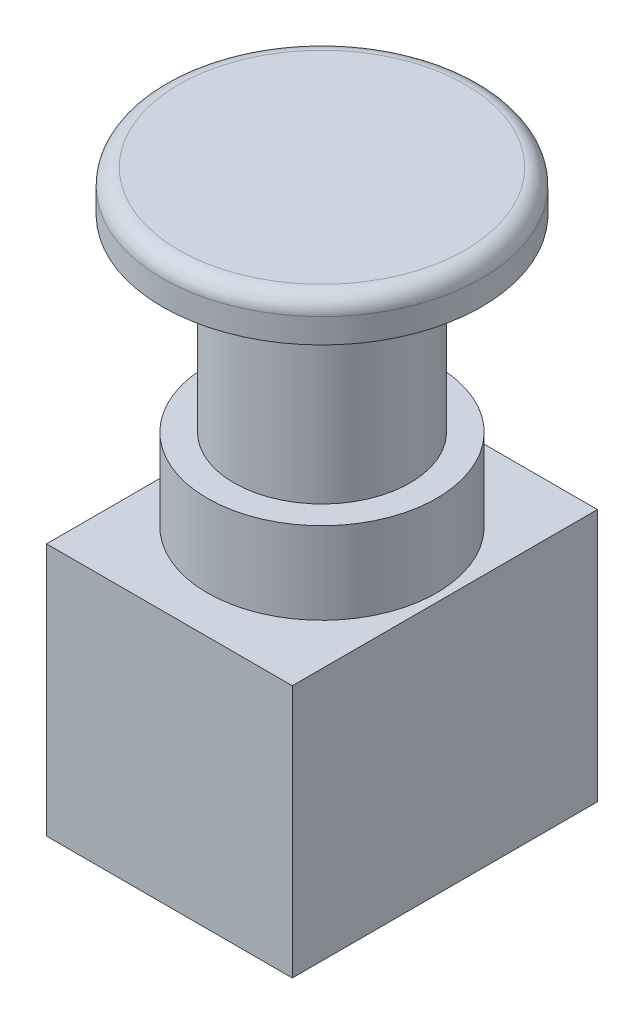
ISO-10303-21;
HEADER;
FILE_DESCRIPTION(('STEP AP214'),'2;1');
FILE_NAME('part.step','',(''),(''),'','','');
FILE_SCHEMA(('AUTOMOTIVE_DESIGN { 1 0 10303 214 1 1 1 1 }'));
ENDSEC;
DATA;
#1=APPLICATION_CONTEXT('core data for automotive mechanical design processes');
#2=APPLICATION_PROTOCOL_DEFINITION('international standard','automotive_design',2000,#1);
#3=PRODUCT_CONTEXT('',#1,'mechanical');
#4=PRODUCT('Part','Part','',(#3));
#5=PRODUCT_RELATED_PRODUCT_CATEGORY('part','',(#4));
#6=PRODUCT_DEFINITION_FORMATION('','',#4);
#7=PRODUCT_DEFINITION_CONTEXT('part definition',#1,'design');
#8=PRODUCT_DEFINITION('design','',#6,#7);
#9=PRODUCT_DEFINITION_SHAPE('','',#8);
#10=(LENGTH_UNIT() NAMED_UNIT(*) SI_UNIT(.MILLI.,.METRE.));
#11=(NAMED_UNIT(*) PLANE_ANGLE_UNIT() SI_UNIT($,.RADIAN.));
#12=(NAMED_UNIT(*) SI_UNIT($,.STERADIAN.) SOLID_ANGLE_UNIT());
#13=UNCERTAINTY_MEASURE_WITH_UNIT(LENGTH_MEASURE(1.E-05),#10,'distance_accuracy_value','');
#14=(GEOMETRIC_REPRESENTATION_CONTEXT(3) GLOBAL_UNCERTAINTY_ASSIGNED_CONTEXT((#13)) GLOBAL_UNIT_ASSIGNED_CONTEXT((#10,
#11,#12)) REPRESENTATION_CONTEXT('',''));
#15=CARTESIAN_POINT('',(0.,0.,0.));
#16=DIRECTION('',(0.,0.,1.));
#17=DIRECTION('',(1.,0.,0.));
#18=AXIS2_PLACEMENT_3D('',#15,#16,#17);
#19=CARTESIAN_POINT('',(0.,68.9,0.));
#20=DIRECTION('',(0.,-1.,0.));
#21=DIRECTION('',(0.,0.,-1.));
#22=AXIS2_PLACEMENT_3D('',#19,#20,#21);
#23=CYLINDRICAL_SURFACE('',#22,19.5);
#24=CARTESIAN_POINT('',(0.,66.9,0.));
#25=DIRECTION('',(0.,1.,0.));
#26=DIRECTION('',(0.,0.,1.));
#27=AXIS2_PLACEMENT_3D('',#24,#25,#26);
#28=CIRCLE('',#27,19.5);
#29=CARTESIAN_POINT('',(0.,66.9,19.5));
#30=VERTEX_POINT('',#29);
#31=EDGE_CURVE('E11',#30,#30,#28,.F.);
#32=ORIENTED_EDGE('',*,*,#31,.T.);
#33=EDGE_LOOP('',(#32));
#34=FACE_BOUND('',#33,.T.);
#35=CARTESIAN_POINT('',(0.,63.9,0.));
#36=DIRECTION('',(0.,1.,0.));
#37=DIRECTION('',(0.,0.,1.));
#38=AXIS2_PLACEMENT_3D('',#35,#36,#37);
#39=CIRCLE('',#38,19.5);
#40=CARTESIAN_POINT('',(0.,63.9,19.5));
#41=VERTEX_POINT('',#40);
#42=EDGE_CURVE('E52',#41,#41,#39,.T.);
#43=ORIENTED_EDGE('',*,*,#42,.T.);
#44=EDGE_LOOP('',(#43));
#45=FACE_BOUND('',#44,.T.);
#46=ADVANCED_FACE('F41',(#34,#45),#23,.T.);
#47=CARTESIAN_POINT('',(0.,68.9,0.));
#48=DIRECTION('',(0.,1.,0.));
#49=DIRECTION('',(0.,0.,1.));
#50=AXIS2_PLACEMENT_3D('',#47,#48,#49);
#51=PLANE('',#50);
#52=CARTESIAN_POINT('',(0.,68.9,0.));
#53=DIRECTION('',(0.,1.,0.));
#54=DIRECTION('',(0.,0.,1.));
#55=AXIS2_PLACEMENT_3D('',#52,#53,#54);
#56=CIRCLE('',#55,17.5);
#57=CARTESIAN_POINT('',(0.,68.9,17.5));
#58=VERTEX_POINT('',#57);
#59=EDGE_CURVE('E48',#58,#58,#56,.T.);
#60=ORIENTED_EDGE('',*,*,#59,.T.);
#61=EDGE_LOOP('',(#60));
#62=FACE_BOUND('',#61,.T.);
#63=ADVANCED_FACE('F62',(#62),#51,.T.);
#64=CARTESIAN_POINT('',(0.,63.9,0.));
#65=DIRECTION('',(0.,1.,0.));
#66=DIRECTION('',(0.,0.,1.));
#67=AXIS2_PLACEMENT_3D('',#64,#65,#66);
#68=PLANE('',#67);
#69=ORIENTED_EDGE('',*,*,#42,.F.);
#70=EDGE_LOOP('',(#69));
#71=FACE_BOUND('',#70,.T.);
#72=ADVANCED_FACE('F60',(#71),#68,.F.);
#73=CARTESIAN_POINT('',(0.,66.9,0.));
#74=DIRECTION('',(0.,1.,0.));
#75=DIRECTION('',(0.,0.,1.));
#76=AXIS2_PLACEMENT_3D('',#73,#74,#75);
#77=TOROIDAL_SURFACE('',#76,17.5,2.);
#78=ORIENTED_EDGE('',*,*,#31,.F.);
#79=EDGE_LOOP('',(#78));
#80=FACE_BOUND('',#79,.T.);
#81=ORIENTED_EDGE('',*,*,#59,.F.);
#82=EDGE_LOOP('',(#81));
#83=FACE_BOUND('',#82,.T.);
#84=ADVANCED_FACE('F43',(#80,#83),#77,.T.);
#85=CLOSED_SHELL('',(#46,#63,#72,#84));
#86=MANIFOLD_SOLID_BREP('B2',#85);
#87=CARTESIAN_POINT('',(15.,30.9,18.625));
#88=DIRECTION('',(-1.,0.,0.));
#89=DIRECTION('',(0.,0.,1.));
#90=AXIS2_PLACEMENT_3D('',#87,#88,#89);
#91=PLANE('',#90);
#92=DIRECTION('',(0.,0.,-1.));
#93=VECTOR('',#92,1.);
#94=CARTESIAN_POINT('',(15.,0.,18.625));
#95=LINE('',#94,#93);
#96=CARTESIAN_POINT('',(15.,0.,18.625));
#97=VERTEX_POINT('',#96);
#98=CARTESIAN_POINT('',(15.,0.,-18.625));
#99=VERTEX_POINT('',#98);
#100=EDGE_CURVE('E164',#97,#99,#95,.T.);
#101=ORIENTED_EDGE('',*,*,#100,.T.);
#102=DIRECTION('',(0.,-1.,0.));
#103=VECTOR('',#102,1.);
#104=CARTESIAN_POINT('',(15.,30.9,-18.625));
#105=LINE('',#104,#103);
#106=CARTESIAN_POINT('',(15.,30.9,-18.625));
#107=VERTEX_POINT('',#106);
#108=EDGE_CURVE('E100',#107,#99,#105,.T.);
#109=ORIENTED_EDGE('',*,*,#108,.F.);
#110=DIRECTION('',(0.,0.,-1.));
#111=VECTOR('',#110,1.);
#112=CARTESIAN_POINT('',(15.,30.9,18.625));
#113=LINE('',#112,#111);
#114=CARTESIAN_POINT('',(15.,30.9,18.625));
#115=VERTEX_POINT('',#114);
#116=EDGE_CURVE('E151',#115,#107,#113,.T.);
#117=ORIENTED_EDGE('',*,*,#116,.F.);
#118=DIRECTION('',(0.,-1.,0.));
#119=VECTOR('',#118,1.);
#120=CARTESIAN_POINT('',(15.,30.9,18.625));
#121=LINE('',#120,#119);
#122=EDGE_CURVE('E160',#115,#97,#121,.T.);
#123=ORIENTED_EDGE('',*,*,#122,.T.);
#124=EDGE_LOOP('',(#101,#109,#117,#123));
#125=FACE_BOUND('',#124,.T.);
#126=ADVANCED_FACE('F97',(#125),#91,.F.);
#127=CARTESIAN_POINT('',(-15.,30.9,-18.625));
#128=DIRECTION('',(0.,0.,1.));
#129=DIRECTION('',(1.,0.,0.));
#130=AXIS2_PLACEMENT_3D('',#127,#128,#129);
#131=PLANE('',#130);
#132=DIRECTION('',(-1.,0.,0.));
#133=VECTOR('',#132,1.);
#134=CARTESIAN_POINT('',(-15.,0.,-18.625));
#135=LINE('',#134,#133);
#136=CARTESIAN_POINT('',(-15.,0.,-18.625));
#137=VERTEX_POINT('',#136);
#138=EDGE_CURVE('E156',#99,#137,#135,.T.);
#139=ORIENTED_EDGE('',*,*,#138,.T.);
#140=DIRECTION('',(0.,-1.,0.));
#141=VECTOR('',#140,1.);
#142=CARTESIAN_POINT('',(-15.,30.9,-18.625));
#143=LINE('',#142,#141);
#144=CARTESIAN_POINT('',(-15.,30.9,-18.625));
#145=VERTEX_POINT('',#144);
#146=EDGE_CURVE('E154',#145,#137,#143,.T.);
#147=ORIENTED_EDGE('',*,*,#146,.F.);
#148=DIRECTION('',(-1.,0.,0.));
#149=VECTOR('',#148,1.);
#150=CARTESIAN_POINT('',(-15.,30.9,-18.625));
#151=LINE('',#150,#149);
#152=EDGE_CURVE('E146',#107,#145,#151,.T.);
#153=ORIENTED_EDGE('',*,*,#152,.F.);
#154=ORIENTED_EDGE('',*,*,#108,.T.);
#155=EDGE_LOOP('',(#139,#147,#153,#154));
#156=FACE_BOUND('',#155,.T.);
#157=ADVANCED_FACE('F155',(#156),#131,.F.);
#158=CARTESIAN_POINT('',(-15.,30.9,18.625));
#159=DIRECTION('',(1.,0.,0.));
#160=DIRECTION('',(0.,0.,-1.));
#161=AXIS2_PLACEMENT_3D('',#158,#159,#160);
#162=PLANE('',#161);
#163=DIRECTION('',(0.,0.,1.));
#164=VECTOR('',#163,1.);
#165=CARTESIAN_POINT('',(-15.,0.,18.625));
#166=LINE('',#165,#164);
#167=CARTESIAN_POINT('',(-15.,0.,18.625));
#168=VERTEX_POINT('',#167);
#169=EDGE_CURVE('E132',#137,#168,#166,.T.);
#170=ORIENTED_EDGE('',*,*,#169,.T.);
#171=DIRECTION('',(0.,-1.,0.));
#172=VECTOR('',#171,1.);
#173=CARTESIAN_POINT('',(-15.,30.9,18.625));
#174=LINE('',#173,#172);
#175=CARTESIAN_POINT('',(-15.,30.9,18.625));
#176=VERTEX_POINT('',#175);
#177=EDGE_CURVE('E157',#176,#168,#174,.T.);
#178=ORIENTED_EDGE('',*,*,#177,.F.);
#179=DIRECTION('',(0.,0.,1.));
#180=VECTOR('',#179,1.);
#181=CARTESIAN_POINT('',(-15.,30.9,18.625));
#182=LINE('',#181,#180);
#183=EDGE_CURVE('E149',#145,#176,#182,.T.);
#184=ORIENTED_EDGE('',*,*,#183,.F.);
#185=ORIENTED_EDGE('',*,*,#146,.T.);
#186=EDGE_LOOP('',(#170,#178,#184,#185));
#187=FACE_BOUND('',#186,.T.);
#188=ADVANCED_FACE('F158',(#187),#162,.F.);
#189=CARTESIAN_POINT('',(-15.,30.9,18.625));
#190=DIRECTION('',(0.,0.,-1.));
#191=DIRECTION('',(-1.,0.,0.));
#192=AXIS2_PLACEMENT_3D('',#189,#190,#191);
#193=PLANE('',#192);
#194=DIRECTION('',(1.,0.,0.));
#195=VECTOR('',#194,1.);
#196=CARTESIAN_POINT('',(-15.,0.,18.625));
#197=LINE('',#196,#195);
#198=EDGE_CURVE('E138',#168,#97,#197,.T.);
#199=ORIENTED_EDGE('',*,*,#198,.T.);
#200=ORIENTED_EDGE('',*,*,#122,.F.);
#201=DIRECTION('',(1.,0.,0.));
#202=VECTOR('',#201,1.);
#203=CARTESIAN_POINT('',(-15.,30.9,18.625));
#204=LINE('',#203,#202);
#205=EDGE_CURVE('E115',#176,#115,#204,.T.);
#206=ORIENTED_EDGE('',*,*,#205,.F.);
#207=ORIENTED_EDGE('',*,*,#177,.T.);
#208=EDGE_LOOP('',(#199,#200,#206,#207));
#209=FACE_BOUND('',#208,.T.);
#210=ADVANCED_FACE('F172',(#209),#193,.F.);
#211=CARTESIAN_POINT('',(0.,30.9,0.));
#212=DIRECTION('',(0.,-1.,0.));
#213=DIRECTION('',(0.,0.,-1.));
#214=AXIS2_PLACEMENT_3D('',#211,#212,#213);
#215=PLANE('',#214);
#216=CARTESIAN_POINT('',(0.,30.9,0.));
#217=DIRECTION('',(0.,1.,0.));
#218=DIRECTION('',(0.,0.,1.));
#219=AXIS2_PLACEMENT_3D('',#216,#217,#218);
#220=CIRCLE('',#219,14.);
#221=CARTESIAN_POINT('',(0.,30.9,14.));
#222=VERTEX_POINT('',#221);
#223=EDGE_CURVE('E106',#222,#222,#220,.T.);
#224=ORIENTED_EDGE('',*,*,#223,.F.);
#225=EDGE_LOOP('',(#224));
#226=FACE_BOUND('',#225,.T.);
#227=ORIENTED_EDGE('',*,*,#116,.T.);
#228=ORIENTED_EDGE('',*,*,#152,.T.);
#229=ORIENTED_EDGE('',*,*,#183,.T.);
#230=ORIENTED_EDGE('',*,*,#205,.T.);
#231=EDGE_LOOP('',(#227,#228,#229,#230));
#232=FACE_BOUND('',#231,.T.);
#233=ADVANCED_FACE('F147',(#226,#232),#215,.F.);
#234=CARTESIAN_POINT('',(0.,0.,0.));
#235=DIRECTION('',(0.,-1.,0.));
#236=DIRECTION('',(0.,0.,-1.));
#237=AXIS2_PLACEMENT_3D('',#234,#235,#236);
#238=PLANE('',#237);
#239=ORIENTED_EDGE('',*,*,#100,.F.);
#240=ORIENTED_EDGE('',*,*,#198,.F.);
#241=ORIENTED_EDGE('',*,*,#169,.F.);
#242=ORIENTED_EDGE('',*,*,#138,.F.);
#243=EDGE_LOOP('',(#239,#240,#241,#242));
#244=FACE_BOUND('',#243,.T.);
#245=ADVANCED_FACE('F175',(#244),#238,.T.);
#246=CARTESIAN_POINT('',(0.,40.9,0.));
#247=DIRECTION('',(0.,-1.,0.));
#248=DIRECTION('',(0.,0.,-1.));
#249=AXIS2_PLACEMENT_3D('',#246,#247,#248);
#250=CYLINDRICAL_SURFACE('',#249,14.);
#251=CARTESIAN_POINT('',(0.,40.9,0.));
#252=DIRECTION('',(0.,1.,0.));
#253=DIRECTION('',(0.,0.,1.));
#254=AXIS2_PLACEMENT_3D('',#251,#252,#253);
#255=CIRCLE('',#254,14.);
#256=CARTESIAN_POINT('',(0.,40.9,14.));
#257=VERTEX_POINT('',#256);
#258=EDGE_CURVE('E167',#257,#257,#255,.T.);
#259=ORIENTED_EDGE('',*,*,#258,.F.);
#260=EDGE_LOOP('',(#259));
#261=FACE_BOUND('',#260,.T.);
#262=ORIENTED_EDGE('',*,*,#223,.T.);
#263=EDGE_LOOP('',(#262));
#264=FACE_BOUND('',#263,.T.);
#265=ADVANCED_FACE('F197',(#261,#264),#250,.T.);
#266=CARTESIAN_POINT('',(0.,40.9,0.));
#267=DIRECTION('',(0.,1.,0.));
#268=DIRECTION('',(0.,0.,1.));
#269=AXIS2_PLACEMENT_3D('',#266,#267,#268);
#270=PLANE('',#269);
#271=CARTESIAN_POINT('',(0.,40.9,0.));
#272=DIRECTION('',(0.,1.,0.));
#273=DIRECTION('',(0.,0.,1.));
#274=AXIS2_PLACEMENT_3D('',#271,#272,#273);
#275=CIRCLE('',#274,10.75);
#276=CARTESIAN_POINT('',(0.,40.9,10.75));
#277=VERTEX_POINT('',#276);
#278=EDGE_CURVE('E39',#277,#277,#275,.T.);
#279=ORIENTED_EDGE('',*,*,#278,.F.);
#280=EDGE_LOOP('',(#279));
#281=FACE_BOUND('',#280,.T.);
#282=ORIENTED_EDGE('',*,*,#258,.T.);
#283=EDGE_LOOP('',(#282));
#284=FACE_BOUND('',#283,.T.);
#285=ADVANCED_FACE('F191',(#281,#284),#270,.T.);
#286=CARTESIAN_POINT('',(0.,63.9,0.));
#287=DIRECTION('',(0.,-1.,0.));
#288=DIRECTION('',(0.,0.,-1.));
#289=AXIS2_PLACEMENT_3D('',#286,#287,#288);
#290=CYLINDRICAL_SURFACE('',#289,10.75);
#291=CARTESIAN_POINT('',(0.,63.9,0.));
#292=DIRECTION('',(0.,1.,0.));
#293=DIRECTION('',(0.,0.,1.));
#294=AXIS2_PLACEMENT_3D('',#291,#292,#293);
#295=CIRCLE('',#294,10.75);
#296=CARTESIAN_POINT('',(0.,63.9,10.75));
#297=VERTEX_POINT('',#296);
#298=EDGE_CURVE('E181',#297,#297,#295,.T.);
#299=ORIENTED_EDGE('',*,*,#298,.F.);
#300=EDGE_LOOP('',(#299));
#301=FACE_BOUND('',#300,.T.);
#302=ORIENTED_EDGE('',*,*,#278,.T.);
#303=EDGE_LOOP('',(#302));
#304=FACE_BOUND('',#303,.T.);
#305=ADVANCED_FACE('F188',(#301,#304),#290,.T.);
#306=CARTESIAN_POINT('',(0.,63.9,0.));
#307=DIRECTION('',(0.,1.,0.));
#308=DIRECTION('',(0.,0.,1.));
#309=AXIS2_PLACEMENT_3D('',#306,#307,#308);
#310=PLANE('',#309);
#311=ORIENTED_EDGE('',*,*,#298,.T.);
#312=EDGE_LOOP('',(#311));
#313=FACE_BOUND('',#312,.T.);
#314=ADVANCED_FACE('F186',(#313),#310,.T.);
#315=CLOSED_SHELL('',(#126,#157,#188,#210,#233,#245,#265,#285,#305,#314));
#316=MANIFOLD_SOLID_BREP('B6',#315);
#317=ADVANCED_BREP_SHAPE_REPRESENTATION('',(#18,#86,#316),#14);
#318=SHAPE_DEFINITION_REPRESENTATION(#9,#317);
ENDSEC;
END-ISO-10303-21;
